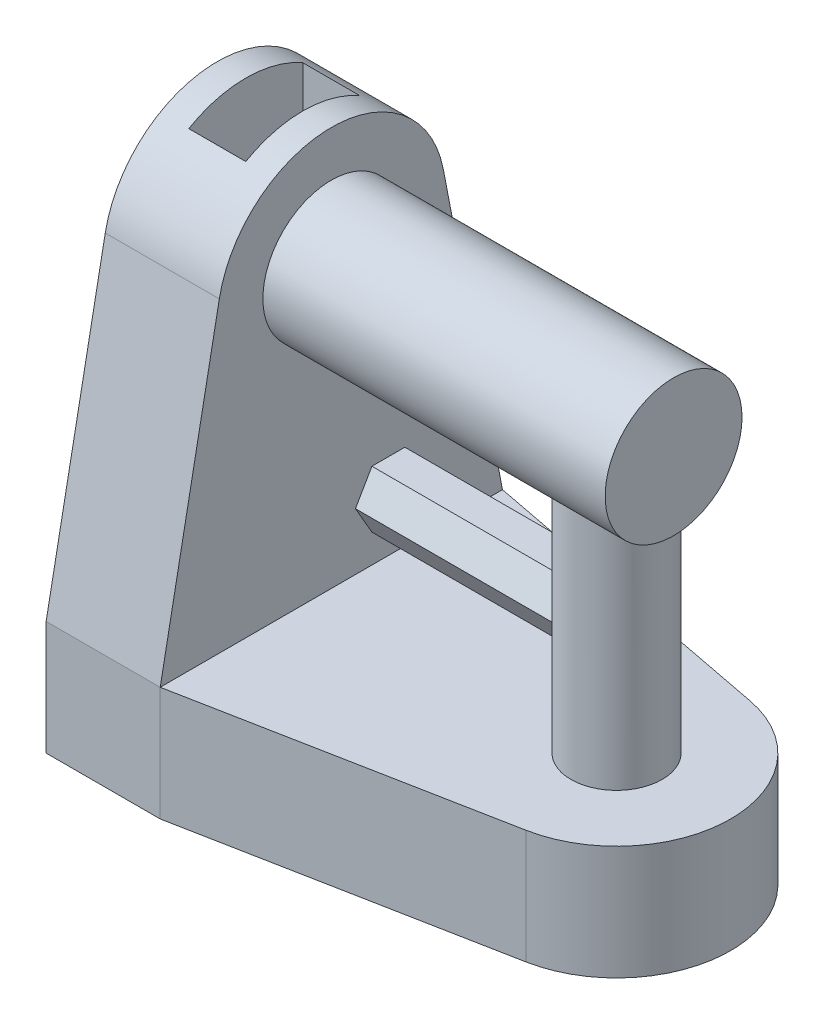
ISO-10303-21;
HEADER;
FILE_DESCRIPTION(('STEP AP214'),'2;1');
FILE_NAME('part.step','',(''),(''),'','','');
FILE_SCHEMA(('AUTOMOTIVE_DESIGN { 1 0 10303 214 1 1 1 1 }'));
ENDSEC;
DATA;
#1=APPLICATION_CONTEXT('core data for automotive mechanical design processes');
#2=APPLICATION_PROTOCOL_DEFINITION('international standard','automotive_design',2000,#1);
#3=PRODUCT_CONTEXT('',#1,'mechanical');
#4=PRODUCT('Part','Part','',(#3));
#5=PRODUCT_RELATED_PRODUCT_CATEGORY('part','',(#4));
#6=PRODUCT_DEFINITION_FORMATION('','',#4);
#7=PRODUCT_DEFINITION_CONTEXT('part definition',#1,'design');
#8=PRODUCT_DEFINITION('design','',#6,#7);
#9=PRODUCT_DEFINITION_SHAPE('','',#8);
#10=(LENGTH_UNIT() NAMED_UNIT(*) SI_UNIT(.MILLI.,.METRE.));
#11=(NAMED_UNIT(*) PLANE_ANGLE_UNIT() SI_UNIT($,.RADIAN.));
#12=(NAMED_UNIT(*) SI_UNIT($,.STERADIAN.) SOLID_ANGLE_UNIT());
#13=UNCERTAINTY_MEASURE_WITH_UNIT(LENGTH_MEASURE(1.E-05),#10,'distance_accuracy_value','');
#14=(GEOMETRIC_REPRESENTATION_CONTEXT(3) GLOBAL_UNCERTAINTY_ASSIGNED_CONTEXT((#13)) GLOBAL_UNIT_ASSIGNED_CONTEXT((#10,
#11,#12)) REPRESENTATION_CONTEXT('',''));
#15=CARTESIAN_POINT('',(0.,0.,0.));
#16=DIRECTION('',(0.,0.,1.));
#17=DIRECTION('',(1.,0.,0.));
#18=AXIS2_PLACEMENT_3D('',#15,#16,#17);
#19=CARTESIAN_POINT('',(5.,35.,0.));
#20=DIRECTION('',(1.,0.,0.));
#21=DIRECTION('',(0.,0.,-1.));
#22=AXIS2_PLACEMENT_3D('',#19,#20,#21);
#23=PLANE('',#22);
#24=DIRECTION('',(0.,0.,1.));
#25=VECTOR('',#24,1.);
#26=CARTESIAN_POINT('',(5.,10.,-15.));
#27=LINE('',#26,#25);
#28=CARTESIAN_POINT('',(5.,10.,-15.));
#29=VERTEX_POINT('',#28);
#30=CARTESIAN_POINT('',(5.,10.,15.));
#31=VERTEX_POINT('',#30);
#32=EDGE_CURVE('E251',#29,#31,#27,.T.);
#33=ORIENTED_EDGE('',*,*,#32,.F.);
#34=DIRECTION('',(0.,-0.981944937507597,-0.189166962504558));
#35=VECTOR('',#34,1.);
#36=CARTESIAN_POINT('',(5.,10.,-15.));
#37=LINE('',#36,#35);
#38=CARTESIAN_POINT('',(5.,36.8916696250456,-9.81944937507597));
#39=VERTEX_POINT('',#38);
#40=EDGE_CURVE('E261',#39,#29,#37,.T.);
#41=ORIENTED_EDGE('',*,*,#40,.F.);
#42=CARTESIAN_POINT('',(5.,35.,0.));
#43=DIRECTION('',(-1.,0.,0.));
#44=DIRECTION('',(0.,0.,-1.));
#45=AXIS2_PLACEMENT_3D('',#42,#43,#44);
#46=CIRCLE('',#45,10.);
#47=CARTESIAN_POINT('',(5.,36.8916696250456,9.81944937507597));
#48=VERTEX_POINT('',#47);
#49=EDGE_CURVE('E258',#48,#39,#46,.T.);
#50=ORIENTED_EDGE('',*,*,#49,.F.);
#51=DIRECTION('',(0.,0.981944937507597,-0.189166962504558));
#52=VECTOR('',#51,1.);
#53=CARTESIAN_POINT('',(5.,10.,15.));
#54=LINE('',#53,#52);
#55=EDGE_CURVE('E254',#31,#48,#54,.T.);
#56=ORIENTED_EDGE('',*,*,#55,.F.);
#57=EDGE_LOOP('',(#33,#41,#50,#56));
#58=FACE_BOUND('',#57,.T.);
#59=CARTESIAN_POINT('',(5.,35.,0.));
#60=DIRECTION('',(1.,0.,0.));
#61=DIRECTION('',(0.,0.,-1.));
#62=AXIS2_PLACEMENT_3D('',#59,#60,#61);
#63=CIRCLE('',#62,6.);
#64=CARTESIAN_POINT('',(5.,35.,-6.));
#65=VERTEX_POINT('',#64);
#66=EDGE_CURVE('E244',#65,#65,#63,.T.);
#67=ORIENTED_EDGE('',*,*,#66,.F.);
#68=EDGE_LOOP('',(#67));
#69=FACE_BOUND('',#68,.T.);
#70=ADVANCED_FACE('F33',(#58,#69),#23,.T.);
#71=CARTESIAN_POINT('',(30.,45.001,0.));
#72=DIRECTION('',(0.,-1.,0.));
#73=DIRECTION('',(0.,0.,-1.));
#74=AXIS2_PLACEMENT_3D('',#71,#72,#73);
#75=CYLINDRICAL_SURFACE('',#74,4.00000000000001);
#76=CARTESIAN_POINT('',(30.,30.5278640450004,-4.00000000000001));
#77=CARTESIAN_POINT('',(30.0976431042768,30.527863470965,-3.99999971701141));
#78=CARTESIAN_POINT('',(30.195294310192,30.5246517403185,-3.99641730612006));
#79=CARTESIAN_POINT('',(30.389671110508,30.5119680627168,-3.98216749684183));
#80=CARTESIAN_POINT('',(30.4863965548096,30.5024951174709,-3.97149896863995));
#81=CARTESIAN_POINT('',(30.6782023082901,30.4777326850487,-3.94327894993262));
#82=CARTESIAN_POINT('',(30.7732803736535,30.4624358307834,-3.92571874076453));
#83=CARTESIAN_POINT('',(30.9610171852617,30.4267031773503,-3.88403234303041));
#84=CARTESIAN_POINT('',(31.0536746671239,30.4062647494913,-3.85990279529086));
#85=CARTESIAN_POINT('',(31.3253430640324,30.3388831274365,-3.77874337281403));
#86=CARTESIAN_POINT('',(31.5001398237842,30.2855733248822,-3.7126228975306));
#87=CARTESIAN_POINT('',(31.8357672417761,30.1683135446415,-3.55867162885036));
#88=CARTESIAN_POINT('',(31.9965949902182,30.1043613581573,-3.47083632675902));
#89=CARTESIAN_POINT('',(32.3272770756849,29.9610824690513,-3.26005745637002));
#90=CARTESIAN_POINT('',(32.4946397531596,29.8809121193299,-3.13377721125875));
#91=CARTESIAN_POINT('',(32.8080299250533,29.7210926060203,-2.85635586366971));
#92=CARTESIAN_POINT('',(32.9540363860923,29.6414440290682,-2.70519055954671));
#93=CARTESIAN_POINT('',(33.1646650048039,29.5217559528442,-2.44937953697576));
#94=CARTESIAN_POINT('',(33.2374144461363,29.479327329696,-2.35243673498693));
#95=CARTESIAN_POINT('',(33.3743781204244,29.3979121788713,-2.15136155819083));
#96=CARTESIAN_POINT('',(33.4385959921753,29.3589241861311,-2.04723227746582));
#97=CARTESIAN_POINT('',(33.5577531929529,29.2855088130281,-1.83234219550542));
#98=CARTESIAN_POINT('',(33.6126977610832,29.2510788599137,-1.72158518694981));
#99=CARTESIAN_POINT('',(33.7125542263129,29.1878088804673,-1.49410810151116));
#100=CARTESIAN_POINT('',(33.7574682724242,29.158967656941,-1.37738930852113));
#101=CARTESIAN_POINT('',(33.8320471350762,29.1106984926508,-1.15232476869448));
#102=CARTESIAN_POINT('',(33.8628568113038,29.0905778506192,-1.04450655364945));
#103=CARTESIAN_POINT('',(33.9154435648975,29.0560700183122,-0.825799105876758));
#104=CARTESIAN_POINT('',(33.9372224112483,29.0416817051936,-0.714910479134198));
#105=CARTESIAN_POINT('',(33.9713394926245,29.0190824980026,-0.491177676230208));
#106=CARTESIAN_POINT('',(33.9836870066422,29.010865532399,-0.378335534131117));
#107=CARTESIAN_POINT('',(33.9987329630872,29.0008473266691,-0.151731846797384));
#108=CARTESIAN_POINT('',(34.0014327669545,28.9990451813132,-0.0379704335570359));
#109=CARTESIAN_POINT('',(33.9974640170715,29.001690307,0.17194106385991));
#110=CARTESIAN_POINT('',(33.9921608550798,29.0052267836771,0.26813220215228));
#111=CARTESIAN_POINT('',(33.9746673416514,29.0168622333477,0.459637324613926));
#112=CARTESIAN_POINT('',(33.9624749746702,29.0249625415595,0.554951043783097));
#113=CARTESIAN_POINT('',(33.9313723751175,29.0455435050924,0.743961586831337));
#114=CARTESIAN_POINT('',(33.9124644273917,29.0580226705751,0.837658949289283));
#115=CARTESIAN_POINT('',(33.8681791185832,29.0870874525479,1.02287485090367));
#116=CARTESIAN_POINT('',(33.8427992486999,29.1036746614238,1.11439253004272));
#117=CARTESIAN_POINT('',(33.7576294483595,29.1589481092498,1.38404430733352));
#118=CARTESIAN_POINT('',(33.6886486766977,29.2032550554807,1.55823034228987));
#119=CARTESIAN_POINT('',(33.528886265822,29.3035812959582,1.89244921235387));
#120=CARTESIAN_POINT('',(33.438100647106,29.3596027279201,2.05247945665022));
#121=CARTESIAN_POINT('',(33.2240481480507,29.4876348904946,2.37655495419077));
#122=CARTESIAN_POINT('',(33.0980806686548,29.5607793602742,2.53836442964145));
#123=CARTESIAN_POINT('',(32.8241869012186,29.7120004467449,2.83999471116366));
#124=CARTESIAN_POINT('',(32.6762267403406,29.790084562927,2.97978090076152));
#125=CARTESIAN_POINT('',(32.4272157467474,29.9122601545878,3.18157014723171));
#126=CARTESIAN_POINT('',(32.3327122786836,29.9567935448526,3.25150721692609));
#127=CARTESIAN_POINT('',(32.1373703349888,30.0441245689221,3.38312626486037));
#128=CARTESIAN_POINT('',(32.0365304414777,30.0869218106838,3.44480638573596));
#129=CARTESIAN_POINT('',(31.7251286099312,30.2104456187102,3.61662345708335));
#130=CARTESIAN_POINT('',(31.5051935364611,30.2865590366495,3.71393763368291));
#131=CARTESIAN_POINT('',(31.1105379100378,30.3947494083539,3.84666645765779));
#132=CARTESIAN_POINT('',(30.9408068425342,30.4331945331535,3.89181903898199));
#133=CARTESIAN_POINT('',(30.5939274265525,30.4918173826758,3.9595879131438));
#134=CARTESIAN_POINT('',(30.4167924976168,30.5120267753625,3.98224328128926));
#135=CARTESIAN_POINT('',(30.059112299703,30.5310493513616,4.00358886469356));
#136=CARTESIAN_POINT('',(29.8785555801528,30.5297694540124,4.00217482316116));
#137=CARTESIAN_POINT('',(29.520632795272,30.5058022611727,3.9752323660432));
#138=CARTESIAN_POINT('',(29.3432694350488,30.4830976129225,3.94968440341475));
#139=CARTESIAN_POINT('',(29.0052210476366,30.4214404824146,3.87799627166597));
#140=CARTESIAN_POINT('',(28.8441445434649,30.3833362662452,3.83292347110555));
#141=CARTESIAN_POINT('',(28.5317475654912,30.2954008260378,3.72446085129647));
#142=CARTESIAN_POINT('',(28.3804303890262,30.2455656646915,3.66106488053104));
#143=CARTESIAN_POINT('',(28.0595959503868,30.127770315384,3.50326678270747));
#144=CARTESIAN_POINT('',(27.8924862465556,30.0581783107192,3.40519994649144));
#145=CARTESIAN_POINT('',(27.575166525284,29.9147497645359,3.18705526067334));
#146=CARTESIAN_POINT('',(27.4249774468881,29.8409081311489,3.06695061214939));
#147=CARTESIAN_POINT('',(27.1120747197568,29.6784861532159,2.77753026108397));
#148=CARTESIAN_POINT('',(26.9537919003245,29.5902098033537,2.60319582989026));
#149=CARTESIAN_POINT('',(26.6683690351654,29.424489516018,2.22621086715598));
#150=CARTESIAN_POINT('',(26.5412014731386,29.3470360337008,2.02358560510326));
#151=CARTESIAN_POINT('',(26.3442092379586,29.2241800771393,1.63493887447291));
#152=CARTESIAN_POINT('',(26.2680622195085,29.1754789418587,1.45320204698569));
#153=CARTESIAN_POINT('',(26.1740745586927,29.1146664778858,1.17138183549999));
#154=CARTESIAN_POINT('',(26.1461149257805,29.0964337937293,1.07589158653011));
#155=CARTESIAN_POINT('',(26.0972694545791,29.0644325439445,0.882402094517285));
#156=CARTESIAN_POINT('',(26.0763807550408,29.0506621727404,0.784403883627614));
#157=CARTESIAN_POINT('',(26.0418835857237,29.0278548236481,0.586086273383305));
#158=CARTESIAN_POINT('',(26.028311496449,29.0188415038965,0.485757815796158));
#159=CARTESIAN_POINT('',(26.008814693063,29.0058773168529,0.284073777175728));
#160=CARTESIAN_POINT('',(26.0028868033578,29.0019243473683,0.182718640298796));
#161=CARTESIAN_POINT('',(25.9987634443807,28.9991757547367,-0.0202340535985191));
#162=CARTESIAN_POINT('',(26.0005691278935,29.0003809004706,-0.121831644503652));
#163=CARTESIAN_POINT('',(26.0118857118074,29.0079187327003,-0.324399587194821));
#164=CARTESIAN_POINT('',(26.0213962615432,29.0142511858412,-0.425369967315856));
#165=CARTESIAN_POINT('',(26.0470023275517,29.0312391873884,-0.618542762281547));
#166=CARTESIAN_POINT('',(26.0625661779277,29.0415452188539,-0.710846956330403));
#167=CARTESIAN_POINT('',(26.0999824795419,29.0662033732281,-0.893633165742335));
#168=CARTESIAN_POINT('',(26.1218370635487,29.0805568683283,-0.984114551962118));
#169=CARTESIAN_POINT('',(26.1964589718197,29.1292695863863,-1.25193819195834));
#170=CARTESIAN_POINT('',(26.2583061330578,29.1692957859349,-1.42581956476814));
#171=CARTESIAN_POINT('',(26.4078823792224,29.2641671012753,-1.77032329578653));
#172=CARTESIAN_POINT('',(26.4969019910084,29.3197356675528,-1.94017490918904));
#173=CARTESIAN_POINT('',(26.6962999124083,29.4404911884233,-2.26309758994045));
#174=CARTESIAN_POINT('',(26.8066910022958,29.505683892742,-2.41615853013136));
#175=CARTESIAN_POINT('',(27.0652584222062,29.6521415723269,-2.72659100620766));
#176=CARTESIAN_POINT('',(27.216646867733,29.7343217266756,-2.88085428517869));
#177=CARTESIAN_POINT('',(27.5422262620958,29.8989328427842,-3.16319975045766));
#178=CARTESIAN_POINT('',(27.7164341109153,29.9813639457616,-3.29126235074366));
#179=CARTESIAN_POINT('',(28.071737644694,30.1323155571641,-3.51026526963469));
#180=CARTESIAN_POINT('',(28.2512923961382,30.2014176035481,-3.60329311149619));
#181=CARTESIAN_POINT('',(28.6265601389144,30.3250506284993,-3.76231587359292));
#182=CARTESIAN_POINT('',(28.8222408392579,30.3796098424283,-3.82836331194185));
#183=CARTESIAN_POINT('',(29.1815682706406,30.4561770402045,-3.91872563367308));
#184=CARTESIAN_POINT('',(29.3427012714296,30.4827196587154,-3.9490458292026));
#185=CARTESIAN_POINT('',(29.5875599518574,30.5096244271931,-3.9795333908914));
#186=CARTESIAN_POINT('',(29.6697124198398,30.5164411842418,-3.98719713542874));
#187=CARTESIAN_POINT('',(29.8345747548414,30.5255606463525,-3.99742989402556));
#188=CARTESIAN_POINT('',(29.9172844704958,30.5278645312779,-4.0000002397256));
#189=CARTESIAN_POINT('',(30.,30.5278640450004,-4.00000000000001));
#190=B_SPLINE_CURVE_WITH_KNOTS('',3,(#76,#77,#78,#79,#80,#81,#82,#83,#84,#85,#86,#87,#88,#89,
#90,#91,#92,#93,#94,#95,#96,#97,#98,#99,#100,#101,#102,#103,#104,#105,#106,#107,#108,#109,#110,
#111,#112,#113,#114,#115,#116,#117,#118,#119,#120,#121,#122,#123,#124,#125,#126,#127,#128,#129,
#130,#131,#132,#133,#134,#135,#136,#137,#138,#139,#140,#141,#142,#143,#144,#145,#146,#147,#148,
#149,#150,#151,#152,#153,#154,#155,#156,#157,#158,#159,#160,#161,#162,#163,#164,#165,#166,#167,
#168,#169,#170,#171,#172,#173,#174,#175,#176,#177,#178,#179,#180,#181,#182,#183,#184,#185,#186,
#187,#188,#189),.UNSPECIFIED.,.T.,.F.,(4,2,2,2,2,2,2,2,2,2,2,2,2,2,2,2,2,2,2,2,2,2,2,2,2,2,2,2,
2,2,2,2,2,2,2,2,2,2,2,2,2,2,2,2,2,2,2,2,2,2,2,2,2,2,2,2,4),(0.,0.292826766938384,
0.585700233571986,0.878945414888604,1.17234082709947,1.75280804501344,2.33339588791187,
3.00435628395762,3.67597311129731,4.06076920977816,4.44540065855947,4.82981407081668,
5.21414504437428,5.55540517330863,5.89659842362192,6.2374555578977,6.57826459009639,
6.86712000583198,7.15605997452398,7.44490173103992,7.73385562594051,8.30887949972941,
8.88400839832559,9.53471337919829,10.1864311561984,10.5631761651892,10.9400057794147,
11.6916411041948,12.2289535173424,12.7653310340256,13.3040324620766,13.8431705807278,
14.3559607435296,14.8689232623495,15.4844163104974,16.1006628454805,16.8515253998696,
17.601721520902,18.2078433216843,18.5109911513255,18.814016165318,19.1185343346241,
19.4229259585792,19.7273629574471,20.0317861015004,20.3139756044281,20.5962608919215,
21.1603518047837,21.7570825066449,22.3541711655486,23.0451693726172,23.736682255299,
24.3754077628613,25.0128839799114,25.509057573012,25.7571821720891,26.0052418918174),.UNSPECIFIED.);
#191=CARTESIAN_POINT('',(30.,30.5278640450004,-4.00000000000001));
#192=VERTEX_POINT('',#191);
#193=EDGE_CURVE('E41',#192,#192,#190,.T.);
#194=ORIENTED_EDGE('',*,*,#193,.T.);
#195=EDGE_LOOP('',(#194));
#196=FACE_BOUND('',#195,.T.);
#197=CARTESIAN_POINT('',(30.,10.,0.));
#198=DIRECTION('',(0.,1.,0.));
#199=DIRECTION('',(0.,0.,1.));
#200=AXIS2_PLACEMENT_3D('',#197,#198,#199);
#201=CIRCLE('',#200,4.00000000000001);
#202=CARTESIAN_POINT('',(30.,10.,4.00000000000001));
#203=VERTEX_POINT('',#202);
#204=EDGE_CURVE('E231',#203,#203,#201,.T.);
#205=ORIENTED_EDGE('',*,*,#204,.T.);
#206=EDGE_LOOP('',(#205));
#207=FACE_BOUND('',#206,.T.);
#208=CARTESIAN_POINT('',(30.,25.,0.));
#209=DIRECTION('',(0.,-0.5,0.866025403784439));
#210=DIRECTION('',(0.,-0.866025403784439,-0.5));
#211=AXIS2_PLACEMENT_3D('',#208,#209,#210);
#212=ELLIPSE('',#211,8.00000000000001,4.00000000000001);
#213=CARTESIAN_POINT('',(27.2311253790678,20.0000000000673,-2.88675134598696));
#214=VERTEX_POINT('',#213);
#215=CARTESIAN_POINT('',(26.2694951190927,22.5,-1.44337567304101));
#216=VERTEX_POINT('',#215);
#217=EDGE_CURVE('E211',#214,#216,#212,.F.);
#218=ORIENTED_EDGE('',*,*,#217,.T.);
#219=CARTESIAN_POINT('',(30.,22.5,0.));
#220=DIRECTION('',(0.,-1.,0.));
#221=DIRECTION('',(0.,0.,-1.));
#222=AXIS2_PLACEMENT_3D('',#219,#220,#221);
#223=CIRCLE('',#222,4.00000000000001);
#224=CARTESIAN_POINT('',(26.2694951190383,22.5,1.44337567297407));
#225=VERTEX_POINT('',#224);
#226=EDGE_CURVE('E216',#216,#225,#223,.F.);
#227=ORIENTED_EDGE('',*,*,#226,.T.);
#228=CARTESIAN_POINT('',(30.,25.,0.));
#229=DIRECTION('',(0.,-0.5,-0.866025403784438));
#230=DIRECTION('',(0.,-0.866025403784439,0.5));
#231=AXIS2_PLACEMENT_3D('',#228,#229,#230);
#232=ELLIPSE('',#231,8.00000000000001,4.00000000000001);
#233=CARTESIAN_POINT('',(27.2311253790192,20.0000000000134,2.88675134594037));
#234=VERTEX_POINT('',#233);
#235=EDGE_CURVE('E233',#225,#234,#232,.F.);
#236=ORIENTED_EDGE('',*,*,#235,.T.);
#237=CARTESIAN_POINT('',(30.,15.,0.));
#238=DIRECTION('',(0.,0.5,-0.866025403784439));
#239=DIRECTION('',(0.,-0.866025403784439,-0.5));
#240=AXIS2_PLACEMENT_3D('',#237,#238,#239);
#241=ELLIPSE('',#240,8.00000000000001,4.00000000000001);
#242=CARTESIAN_POINT('',(26.2694951190668,17.5,1.44337567297407));
#243=VERTEX_POINT('',#242);
#244=EDGE_CURVE('E235',#234,#243,#241,.F.);
#245=ORIENTED_EDGE('',*,*,#244,.T.);
#246=CARTESIAN_POINT('',(30.,17.5,0.));
#247=DIRECTION('',(0.,1.,0.));
#248=DIRECTION('',(0.,0.,1.));
#249=AXIS2_PLACEMENT_3D('',#246,#247,#248);
#250=CIRCLE('',#249,4.00000000000001);
#251=CARTESIAN_POINT('',(26.2694951190631,17.5,-1.44337567296449));
#252=VERTEX_POINT('',#251);
#253=EDGE_CURVE('E237',#243,#252,#250,.F.);
#254=ORIENTED_EDGE('',*,*,#253,.T.);
#255=CARTESIAN_POINT('',(30.,15.,0.));
#256=DIRECTION('',(0.,0.5,0.866025403784439));
#257=DIRECTION('',(0.,-0.866025403784439,0.5));
#258=AXIS2_PLACEMENT_3D('',#255,#256,#257);
#259=ELLIPSE('',#258,8.00000000000002,4.00000000000001);
#260=EDGE_CURVE('E239',#252,#214,#259,.F.);
#261=ORIENTED_EDGE('',*,*,#260,.T.);
#262=EDGE_LOOP('',(#218,#227,#236,#245,#254,#261));
#263=FACE_BOUND('',#262,.T.);
#264=ADVANCED_FACE('F326',(#196,#207,#263),#75,.T.);
#265=CARTESIAN_POINT('',(0.,10.,0.));
#266=DIRECTION('',(0.,1.,0.));
#267=DIRECTION('',(0.,0.,1.));
#268=AXIS2_PLACEMENT_3D('',#265,#266,#267);
#269=PLANE('',#268);
#270=DIRECTION('',(0.981944937507597,0.,0.189166962504558));
#271=VECTOR('',#270,1.);
#272=CARTESIAN_POINT('',(2.96519381614161,10.,-15.3919956103272));
#273=LINE('',#272,#271);
#274=CARTESIAN_POINT('',(31.8916696250456,10.,-9.81944937507597));
#275=VERTEX_POINT('',#274);
#276=EDGE_CURVE('E285',#29,#275,#273,.T.);
#277=ORIENTED_EDGE('',*,*,#276,.F.);
#278=ORIENTED_EDGE('',*,*,#32,.T.);
#279=DIRECTION('',(0.981944937507597,0.,-0.189166962504558));
#280=VECTOR('',#279,1.);
#281=CARTESIAN_POINT('',(2.96519381614161,10.,15.3919956103272));
#282=LINE('',#281,#280);
#283=CARTESIAN_POINT('',(31.8916696250456,10.,9.81944937507597));
#284=VERTEX_POINT('',#283);
#285=EDGE_CURVE('E279',#31,#284,#282,.T.);
#286=ORIENTED_EDGE('',*,*,#285,.T.);
#287=CARTESIAN_POINT('',(30.,10.,0.));
#288=DIRECTION('',(0.,1.,0.));
#289=DIRECTION('',(0.,0.,1.));
#290=AXIS2_PLACEMENT_3D('',#287,#288,#289);
#291=CIRCLE('',#290,10.);
#292=EDGE_CURVE('E282',#275,#284,#291,.F.);
#293=ORIENTED_EDGE('',*,*,#292,.F.);
#294=EDGE_LOOP('',(#277,#278,#286,#293));
#295=FACE_BOUND('',#294,.T.);
#296=ORIENTED_EDGE('',*,*,#204,.F.);
#297=EDGE_LOOP('',(#296));
#298=FACE_BOUND('',#297,.T.);
#299=ADVANCED_FACE('F330',(#295,#298),#269,.T.);
#300=CARTESIAN_POINT('',(35.,35.,0.));
#301=DIRECTION('',(-1.,0.,0.));
#302=DIRECTION('',(0.,0.,1.));
#303=AXIS2_PLACEMENT_3D('',#300,#301,#302);
#304=CYLINDRICAL_SURFACE('',#303,6.);
#305=ORIENTED_EDGE('',*,*,#66,.T.);
#306=EDGE_LOOP('',(#305));
#307=FACE_BOUND('',#306,.T.);
#308=CARTESIAN_POINT('',(35.,35.,0.));
#309=DIRECTION('',(1.,0.,0.));
#310=DIRECTION('',(0.,0.,-1.));
#311=AXIS2_PLACEMENT_3D('',#308,#309,#310);
#312=CIRCLE('',#311,6.);
#313=CARTESIAN_POINT('',(35.,35.,-6.));
#314=VERTEX_POINT('',#313);
#315=EDGE_CURVE('E245',#314,#314,#312,.T.);
#316=ORIENTED_EDGE('',*,*,#315,.F.);
#317=EDGE_LOOP('',(#316));
#318=FACE_BOUND('',#317,.T.);
#319=ORIENTED_EDGE('',*,*,#193,.F.);
#320=EDGE_LOOP('',(#319));
#321=FACE_BOUND('',#320,.T.);
#322=ADVANCED_FACE('F322',(#307,#318,#321),#304,.T.);
#323=CARTESIAN_POINT('',(-5.,10.,0.));
#324=DIRECTION('',(-1.,0.,0.));
#325=DIRECTION('',(0.,0.,1.));
#326=AXIS2_PLACEMENT_3D('',#323,#324,#325);
#327=PLANE('',#326);
#328=DIRECTION('',(0.,0.,-1.));
#329=VECTOR('',#328,1.);
#330=CARTESIAN_POINT('',(-5.,0.,0.));
#331=LINE('',#330,#329);
#332=CARTESIAN_POINT('',(-5.,0.,15.));
#333=VERTEX_POINT('',#332);
#334=CARTESIAN_POINT('',(-5.,0.,-15.));
#335=VERTEX_POINT('',#334);
#336=EDGE_CURVE('E274',#333,#335,#331,.T.);
#337=ORIENTED_EDGE('',*,*,#336,.F.);
#338=DIRECTION('',(0.,-1.,0.));
#339=VECTOR('',#338,1.);
#340=CARTESIAN_POINT('',(-5.,10.,15.));
#341=LINE('',#340,#339);
#342=CARTESIAN_POINT('',(-5.,10.,15.));
#343=VERTEX_POINT('',#342);
#344=EDGE_CURVE('E316',#343,#333,#341,.T.);
#345=ORIENTED_EDGE('',*,*,#344,.F.);
#346=DIRECTION('',(0.,0.981944937507597,-0.189166962504558));
#347=VECTOR('',#346,1.);
#348=CARTESIAN_POINT('',(-5.,10.,15.));
#349=LINE('',#348,#347);
#350=CARTESIAN_POINT('',(-5.,36.8916696250456,9.81944937507597));
#351=VERTEX_POINT('',#350);
#352=EDGE_CURVE('E248',#343,#351,#349,.T.);
#353=ORIENTED_EDGE('',*,*,#352,.T.);
#354=CARTESIAN_POINT('',(-5.,35.,0.));
#355=DIRECTION('',(-1.,0.,0.));
#356=DIRECTION('',(0.,0.,-1.));
#357=AXIS2_PLACEMENT_3D('',#354,#355,#356);
#358=CIRCLE('',#357,10.);
#359=CARTESIAN_POINT('',(-5.,36.8916696250456,-9.81944937507597));
#360=VERTEX_POINT('',#359);
#361=EDGE_CURVE('E267',#351,#360,#358,.T.);
#362=ORIENTED_EDGE('',*,*,#361,.T.);
#363=DIRECTION('',(0.,-0.981944937507597,-0.189166962504558));
#364=VECTOR('',#363,1.);
#365=CARTESIAN_POINT('',(-5.,10.,-15.));
#366=LINE('',#365,#364);
#367=CARTESIAN_POINT('',(-5.,10.,-15.));
#368=VERTEX_POINT('',#367);
#369=EDGE_CURVE('E255',#360,#368,#366,.T.);
#370=ORIENTED_EDGE('',*,*,#369,.T.);
#371=DIRECTION('',(0.,-1.,0.));
#372=VECTOR('',#371,1.);
#373=CARTESIAN_POINT('',(-5.,10.,-15.));
#374=LINE('',#373,#372);
#375=EDGE_CURVE('E290',#368,#335,#374,.T.);
#376=ORIENTED_EDGE('',*,*,#375,.T.);
#377=EDGE_LOOP('',(#337,#345,#353,#362,#370,#376));
#378=FACE_BOUND('',#377,.T.);
#379=ADVANCED_FACE('F35',(#378),#327,.T.);
#380=CARTESIAN_POINT('',(0.,10.,15.));
#381=DIRECTION('',(0.,0.,1.));
#382=DIRECTION('',(1.,0.,0.));
#383=AXIS2_PLACEMENT_3D('',#380,#381,#382);
#384=PLANE('',#383);
#385=DIRECTION('',(-1.,0.,0.));
#386=VECTOR('',#385,1.);
#387=CARTESIAN_POINT('',(0.,0.,15.));
#388=LINE('',#387,#386);
#389=CARTESIAN_POINT('',(5.,0.,15.));
#390=VERTEX_POINT('',#389);
#391=EDGE_CURVE('E293',#390,#333,#388,.T.);
#392=ORIENTED_EDGE('',*,*,#391,.F.);
#393=DIRECTION('',(0.,-1.,0.));
#394=VECTOR('',#393,1.);
#395=CARTESIAN_POINT('',(5.,10.,15.));
#396=LINE('',#395,#394);
#397=EDGE_CURVE('E314',#31,#390,#396,.T.);
#398=ORIENTED_EDGE('',*,*,#397,.F.);
#399=DIRECTION('',(-1.,0.,0.));
#400=VECTOR('',#399,1.);
#401=CARTESIAN_POINT('',(0.,10.,15.));
#402=LINE('',#401,#400);
#403=EDGE_CURVE('E276',#31,#343,#402,.T.);
#404=ORIENTED_EDGE('',*,*,#403,.T.);
#405=ORIENTED_EDGE('',*,*,#344,.T.);
#406=EDGE_LOOP('',(#392,#398,#404,#405));
#407=FACE_BOUND('',#406,.T.);
#408=ADVANCED_FACE('F388',(#407),#384,.T.);
#409=CARTESIAN_POINT('',(2.96519381614161,10.,15.3919956103272));
#410=DIRECTION('',(-0.189166962504558,0.,-0.981944937507597));
#411=DIRECTION('',(-0.981944937507597,0.,0.189166962504558));
#412=AXIS2_PLACEMENT_3D('',#409,#410,#411);
#413=PLANE('',#412);
#414=DIRECTION('',(0.981944937507597,0.,-0.189166962504558));
#415=VECTOR('',#414,1.);
#416=CARTESIAN_POINT('',(2.96519381614161,0.,15.3919956103272));
#417=LINE('',#416,#415);
#418=CARTESIAN_POINT('',(31.8916696250456,0.,9.81944937507597));
#419=VERTEX_POINT('',#418);
#420=EDGE_CURVE('E296',#390,#419,#417,.T.);
#421=ORIENTED_EDGE('',*,*,#420,.T.);
#422=DIRECTION('',(0.,-1.,0.));
#423=VECTOR('',#422,1.);
#424=CARTESIAN_POINT('',(31.8916696250456,10.,9.81944937507597));
#425=LINE('',#424,#423);
#426=EDGE_CURVE('E312',#284,#419,#425,.T.);
#427=ORIENTED_EDGE('',*,*,#426,.F.);
#428=ORIENTED_EDGE('',*,*,#285,.F.);
#429=ORIENTED_EDGE('',*,*,#397,.T.);
#430=EDGE_LOOP('',(#421,#427,#428,#429));
#431=FACE_BOUND('',#430,.T.);
#432=ADVANCED_FACE('F385',(#431),#413,.F.);
#433=CARTESIAN_POINT('',(30.,10.,0.));
#434=DIRECTION('',(0.,-1.,0.));
#435=DIRECTION('',(0.,0.,-1.));
#436=AXIS2_PLACEMENT_3D('',#433,#434,#435);
#437=CYLINDRICAL_SURFACE('',#436,10.);
#438=CARTESIAN_POINT('',(30.,0.,0.));
#439=DIRECTION('',(0.,1.,0.));
#440=DIRECTION('',(0.,0.,1.));
#441=AXIS2_PLACEMENT_3D('',#438,#439,#440);
#442=CIRCLE('',#441,10.);
#443=CARTESIAN_POINT('',(31.8916696250456,0.,-9.81944937507597));
#444=VERTEX_POINT('',#443);
#445=EDGE_CURVE('E299',#444,#419,#442,.F.);
#446=ORIENTED_EDGE('',*,*,#445,.F.);
#447=DIRECTION('',(0.,-1.,0.));
#448=VECTOR('',#447,1.);
#449=CARTESIAN_POINT('',(31.8916696250456,10.,-9.81944937507597));
#450=LINE('',#449,#448);
#451=EDGE_CURVE('E310',#275,#444,#450,.T.);
#452=ORIENTED_EDGE('',*,*,#451,.F.);
#453=ORIENTED_EDGE('',*,*,#292,.T.);
#454=ORIENTED_EDGE('',*,*,#426,.T.);
#455=EDGE_LOOP('',(#446,#452,#453,#454));
#456=FACE_BOUND('',#455,.T.);
#457=ADVANCED_FACE('F381',(#456),#437,.T.);
#458=CARTESIAN_POINT('',(2.96519381614161,10.,-15.3919956103272));
#459=DIRECTION('',(0.189166962504558,0.,-0.981944937507597));
#460=DIRECTION('',(-0.981944937507597,0.,-0.189166962504558));
#461=AXIS2_PLACEMENT_3D('',#458,#459,#460);
#462=PLANE('',#461);
#463=DIRECTION('',(0.981944937507597,0.,0.189166962504558));
#464=VECTOR('',#463,1.);
#465=CARTESIAN_POINT('',(2.96519381614161,0.,-15.3919956103272));
#466=LINE('',#465,#464);
#467=CARTESIAN_POINT('',(5.,0.,-15.));
#468=VERTEX_POINT('',#467);
#469=EDGE_CURVE('E302',#468,#444,#466,.T.);
#470=ORIENTED_EDGE('',*,*,#469,.F.);
#471=DIRECTION('',(0.,-1.,0.));
#472=VECTOR('',#471,1.);
#473=CARTESIAN_POINT('',(5.,10.,-15.));
#474=LINE('',#473,#472);
#475=EDGE_CURVE('E308',#29,#468,#474,.T.);
#476=ORIENTED_EDGE('',*,*,#475,.F.);
#477=ORIENTED_EDGE('',*,*,#276,.T.);
#478=ORIENTED_EDGE('',*,*,#451,.T.);
#479=EDGE_LOOP('',(#470,#476,#477,#478));
#480=FACE_BOUND('',#479,.T.);
#481=ADVANCED_FACE('F377',(#480),#462,.T.);
#482=CARTESIAN_POINT('',(0.,10.,-15.));
#483=DIRECTION('',(0.,0.,1.));
#484=DIRECTION('',(1.,0.,0.));
#485=AXIS2_PLACEMENT_3D('',#482,#483,#484);
#486=PLANE('',#485);
#487=DIRECTION('',(-1.,0.,0.));
#488=VECTOR('',#487,1.);
#489=CARTESIAN_POINT('',(0.,0.,-15.));
#490=LINE('',#489,#488);
#491=EDGE_CURVE('E280',#468,#335,#490,.T.);
#492=ORIENTED_EDGE('',*,*,#491,.T.);
#493=ORIENTED_EDGE('',*,*,#375,.F.);
#494=DIRECTION('',(-1.,0.,0.));
#495=VECTOR('',#494,1.);
#496=CARTESIAN_POINT('',(0.,10.,-15.));
#497=LINE('',#496,#495);
#498=EDGE_CURVE('E288',#29,#368,#497,.T.);
#499=ORIENTED_EDGE('',*,*,#498,.F.);
#500=ORIENTED_EDGE('',*,*,#475,.T.);
#501=EDGE_LOOP('',(#492,#493,#499,#500));
#502=FACE_BOUND('',#501,.T.);
#503=ADVANCED_FACE('F373',(#502),#486,.F.);
#504=CARTESIAN_POINT('',(0.,0.,0.));
#505=DIRECTION('',(0.,1.,0.));
#506=DIRECTION('',(0.,0.,1.));
#507=AXIS2_PLACEMENT_3D('',#504,#505,#506);
#508=PLANE('',#507);
#509=ORIENTED_EDGE('',*,*,#336,.T.);
#510=ORIENTED_EDGE('',*,*,#491,.F.);
#511=ORIENTED_EDGE('',*,*,#469,.T.);
#512=ORIENTED_EDGE('',*,*,#445,.T.);
#513=ORIENTED_EDGE('',*,*,#420,.F.);
#514=ORIENTED_EDGE('',*,*,#391,.T.);
#515=EDGE_LOOP('',(#509,#510,#511,#512,#513,#514));
#516=FACE_BOUND('',#515,.T.);
#517=ADVANCED_FACE('F364',(#516),#508,.F.);
#518=CARTESIAN_POINT('',(5.,10.,-15.));
#519=DIRECTION('',(0.,0.189166962504558,-0.981944937507597));
#520=DIRECTION('',(0.,0.981944937507597,0.189166962504558));
#521=AXIS2_PLACEMENT_3D('',#518,#519,#520);
#522=PLANE('',#521);
#523=ORIENTED_EDGE('',*,*,#369,.F.);
#524=DIRECTION('',(-1.,0.,0.));
#525=VECTOR('',#524,1.);
#526=CARTESIAN_POINT('',(5.,36.8916696250456,-9.81944937507597));
#527=LINE('',#526,#525);
#528=EDGE_CURVE('E272',#39,#360,#527,.T.);
#529=ORIENTED_EDGE('',*,*,#528,.F.);
#530=ORIENTED_EDGE('',*,*,#40,.T.);
#531=ORIENTED_EDGE('',*,*,#498,.T.);
#532=EDGE_LOOP('',(#523,#529,#530,#531));
#533=FACE_BOUND('',#532,.T.);
#534=ADVANCED_FACE('F361',(#533),#522,.T.);
#535=CARTESIAN_POINT('',(5.,35.,0.));
#536=DIRECTION('',(-1.,0.,0.));
#537=DIRECTION('',(0.,0.,1.));
#538=AXIS2_PLACEMENT_3D('',#535,#536,#537);
#539=CYLINDRICAL_SURFACE('',#538,10.);
#540=DIRECTION('',(-1.,0.,0.));
#541=VECTOR('',#540,1.);
#542=CARTESIAN_POINT('',(5.,43.6602540378444,5.));
#543=LINE('',#542,#541);
#544=CARTESIAN_POINT('',(2.5,43.6602540378444,5.));
#545=VERTEX_POINT('',#544);
#546=CARTESIAN_POINT('',(-2.5,43.6602540378444,5.));
#547=VERTEX_POINT('',#546);
#548=EDGE_CURVE('E174',#545,#547,#543,.T.);
#549=ORIENTED_EDGE('',*,*,#548,.T.);
#550=CARTESIAN_POINT('',(-2.5,35.,0.));
#551=DIRECTION('',(-1.,0.,0.));
#552=DIRECTION('',(0.,0.,1.));
#553=AXIS2_PLACEMENT_3D('',#550,#551,#552);
#554=CIRCLE('',#553,10.);
#555=CARTESIAN_POINT('',(-2.5,43.6602540378444,-5.));
#556=VERTEX_POINT('',#555);
#557=EDGE_CURVE('E158',#547,#556,#554,.T.);
#558=ORIENTED_EDGE('',*,*,#557,.T.);
#559=DIRECTION('',(-1.,0.,0.));
#560=VECTOR('',#559,1.);
#561=CARTESIAN_POINT('',(5.,43.6602540378444,-5.));
#562=LINE('',#561,#560);
#563=CARTESIAN_POINT('',(2.5,43.6602540378444,-5.));
#564=VERTEX_POINT('',#563);
#565=EDGE_CURVE('E194',#564,#556,#562,.T.);
#566=ORIENTED_EDGE('',*,*,#565,.F.);
#567=CARTESIAN_POINT('',(2.5,35.,0.));
#568=DIRECTION('',(1.,0.,0.));
#569=DIRECTION('',(0.,0.,-1.));
#570=AXIS2_PLACEMENT_3D('',#567,#568,#569);
#571=CIRCLE('',#570,10.);
#572=EDGE_CURVE('E183',#564,#545,#571,.T.);
#573=ORIENTED_EDGE('',*,*,#572,.T.);
#574=EDGE_LOOP('',(#549,#558,#566,#573));
#575=FACE_BOUND('',#574,.T.);
#576=ORIENTED_EDGE('',*,*,#361,.F.);
#577=DIRECTION('',(-1.,0.,0.));
#578=VECTOR('',#577,1.);
#579=CARTESIAN_POINT('',(5.,36.8916696250456,9.81944937507597));
#580=LINE('',#579,#578);
#581=EDGE_CURVE('E264',#48,#351,#580,.T.);
#582=ORIENTED_EDGE('',*,*,#581,.F.);
#583=ORIENTED_EDGE('',*,*,#49,.T.);
#584=ORIENTED_EDGE('',*,*,#528,.T.);
#585=EDGE_LOOP('',(#576,#582,#583,#584));
#586=FACE_BOUND('',#585,.T.);
#587=ADVANCED_FACE('F181',(#575,#586),#539,.T.);
#588=CARTESIAN_POINT('',(5.,10.,15.));
#589=DIRECTION('',(0.,0.189166962504558,0.981944937507597));
#590=DIRECTION('',(0.,-0.981944937507597,0.189166962504558));
#591=AXIS2_PLACEMENT_3D('',#588,#589,#590);
#592=PLANE('',#591);
#593=ORIENTED_EDGE('',*,*,#352,.F.);
#594=ORIENTED_EDGE('',*,*,#403,.F.);
#595=ORIENTED_EDGE('',*,*,#55,.T.);
#596=ORIENTED_EDGE('',*,*,#581,.T.);
#597=EDGE_LOOP('',(#593,#594,#595,#596));
#598=FACE_BOUND('',#597,.T.);
#599=ADVANCED_FACE('F337',(#598),#592,.T.);
#600=CARTESIAN_POINT('',(35.,35.,0.));
#601=DIRECTION('',(1.,0.,0.));
#602=DIRECTION('',(0.,0.,-1.));
#603=AXIS2_PLACEMENT_3D('',#600,#601,#602);
#604=PLANE('',#603);
#605=ORIENTED_EDGE('',*,*,#315,.T.);
#606=EDGE_LOOP('',(#605));
#607=FACE_BOUND('',#606,.T.);
#608=ADVANCED_FACE('F334',(#607),#604,.T.);
#609=CARTESIAN_POINT('',(500000.,20.,-2.88675134594813));
#610=DIRECTION('',(0.,-0.5,0.866025403784439));
#611=DIRECTION('',(0.,-0.866025403784439,-0.5));
#612=AXIS2_PLACEMENT_3D('',#609,#610,#611);
#613=PLANE('',#612);
#614=DIRECTION('',(-1.,0.,0.));
#615=VECTOR('',#614,1.);
#616=CARTESIAN_POINT('',(500000.,20.,-2.88675134594813));
#617=LINE('',#616,#615);
#618=CARTESIAN_POINT('',(9.99999999999091,20.0000000000673,-2.88675134598696));
#619=VERTEX_POINT('',#618);
#620=EDGE_CURVE('E225',#214,#619,#617,.T.);
#621=ORIENTED_EDGE('',*,*,#620,.T.);
#622=DIRECTION('',(0.,0.866025403784439,0.5));
#623=VECTOR('',#622,1.);
#624=CARTESIAN_POINT('',(9.99999999999091,20.,-2.88675134594813));
#625=LINE('',#624,#623);
#626=CARTESIAN_POINT('',(9.99999999999091,22.5,-1.44337567304101));
#627=VERTEX_POINT('',#626);
#628=EDGE_CURVE('E208',#619,#627,#625,.T.);
#629=ORIENTED_EDGE('',*,*,#628,.T.);
#630=DIRECTION('',(-1.,0.,0.));
#631=VECTOR('',#630,1.);
#632=CARTESIAN_POINT('',(500000.,22.5,-1.44337567297406));
#633=LINE('',#632,#631);
#634=EDGE_CURVE('E228',#216,#627,#633,.T.);
#635=ORIENTED_EDGE('',*,*,#634,.F.);
#636=ORIENTED_EDGE('',*,*,#217,.F.);
#637=EDGE_LOOP('',(#621,#629,#635,#636));
#638=FACE_BOUND('',#637,.T.);
#639=ADVANCED_FACE('F336',(#638),#613,.F.);
#640=CARTESIAN_POINT('',(500000.,17.5,-1.44337567297406));
#641=DIRECTION('',(0.,0.5,0.866025403784439));
#642=DIRECTION('',(0.,-0.866025403784439,0.5));
#643=AXIS2_PLACEMENT_3D('',#640,#641,#642);
#644=PLANE('',#643);
#645=DIRECTION('',(-1.,0.,0.));
#646=VECTOR('',#645,1.);
#647=CARTESIAN_POINT('',(500000.,17.5,-1.44337567297406));
#648=LINE('',#647,#646);
#649=CARTESIAN_POINT('',(9.99999999999091,17.5,-1.44337567297406));
#650=VERTEX_POINT('',#649);
#651=EDGE_CURVE('E222',#252,#650,#648,.T.);
#652=ORIENTED_EDGE('',*,*,#651,.T.);
#653=DIRECTION('',(0.,0.866025403784439,-0.5));
#654=VECTOR('',#653,1.);
#655=CARTESIAN_POINT('',(9.99999999999091,17.5,-1.44337567297406));
#656=LINE('',#655,#654);
#657=EDGE_CURVE('E205',#650,#619,#656,.T.);
#658=ORIENTED_EDGE('',*,*,#657,.T.);
#659=ORIENTED_EDGE('',*,*,#620,.F.);
#660=ORIENTED_EDGE('',*,*,#260,.F.);
#661=EDGE_LOOP('',(#652,#658,#659,#660));
#662=FACE_BOUND('',#661,.T.);
#663=ADVANCED_FACE('F344',(#662),#644,.F.);
#664=CARTESIAN_POINT('',(500000.,17.5,1.44337567297407));
#665=DIRECTION('',(0.,1.,0.));
#666=DIRECTION('',(0.,0.,1.));
#667=AXIS2_PLACEMENT_3D('',#664,#665,#666);
#668=PLANE('',#667);
#669=DIRECTION('',(-1.,0.,0.));
#670=VECTOR('',#669,1.);
#671=CARTESIAN_POINT('',(500000.,17.5,1.44337567297407));
#672=LINE('',#671,#670);
#673=CARTESIAN_POINT('',(9.99999999999091,17.5,1.44337567297406));
#674=VERTEX_POINT('',#673);
#675=EDGE_CURVE('E219',#243,#674,#672,.T.);
#676=ORIENTED_EDGE('',*,*,#675,.T.);
#677=DIRECTION('',(0.,0.,-1.));
#678=VECTOR('',#677,1.);
#679=CARTESIAN_POINT('',(9.99999999999091,17.5,1.44337567297407));
#680=LINE('',#679,#678);
#681=EDGE_CURVE('E202',#674,#650,#680,.T.);
#682=ORIENTED_EDGE('',*,*,#681,.T.);
#683=ORIENTED_EDGE('',*,*,#651,.F.);
#684=ORIENTED_EDGE('',*,*,#253,.F.);
#685=EDGE_LOOP('',(#676,#682,#683,#684));
#686=FACE_BOUND('',#685,.T.);
#687=ADVANCED_FACE('F432',(#686),#668,.F.);
#688=CARTESIAN_POINT('',(500000.,20.,2.88675134594813));
#689=DIRECTION('',(0.,0.5,-0.866025403784439));
#690=DIRECTION('',(0.,0.866025403784439,0.5));
#691=AXIS2_PLACEMENT_3D('',#688,#689,#690);
#692=PLANE('',#691);
#693=DIRECTION('',(-1.,0.,0.));
#694=VECTOR('',#693,1.);
#695=CARTESIAN_POINT('',(500000.,20.,2.88675134594813));
#696=LINE('',#695,#694);
#697=CARTESIAN_POINT('',(9.99999999999091,20.,2.88675134594813));
#698=VERTEX_POINT('',#697);
#699=EDGE_CURVE('E215',#234,#698,#696,.T.);
#700=ORIENTED_EDGE('',*,*,#699,.T.);
#701=DIRECTION('',(0.,-0.866025403784439,-0.5));
#702=VECTOR('',#701,1.);
#703=CARTESIAN_POINT('',(9.99999999999091,20.,2.88675134594813));
#704=LINE('',#703,#702);
#705=EDGE_CURVE('E56',#698,#674,#704,.T.);
#706=ORIENTED_EDGE('',*,*,#705,.T.);
#707=ORIENTED_EDGE('',*,*,#675,.F.);
#708=ORIENTED_EDGE('',*,*,#244,.F.);
#709=EDGE_LOOP('',(#700,#706,#707,#708));
#710=FACE_BOUND('',#709,.T.);
#711=ADVANCED_FACE('F435',(#710),#692,.F.);
#712=CARTESIAN_POINT('',(500000.,22.5,-1.44337567297406));
#713=DIRECTION('',(0.,-1.,0.));
#714=DIRECTION('',(0.,0.,-1.));
#715=AXIS2_PLACEMENT_3D('',#712,#713,#714);
#716=PLANE('',#715);
#717=ORIENTED_EDGE('',*,*,#634,.T.);
#718=DIRECTION('',(0.,0.,1.));
#719=VECTOR('',#718,1.);
#720=CARTESIAN_POINT('',(9.99999999999091,22.5,-1.44337567297406));
#721=LINE('',#720,#719);
#722=CARTESIAN_POINT('',(9.99999999999091,22.5,1.44337567297407));
#723=VERTEX_POINT('',#722);
#724=EDGE_CURVE('E168',#627,#723,#721,.T.);
#725=ORIENTED_EDGE('',*,*,#724,.T.);
#726=DIRECTION('',(-1.,0.,0.));
#727=VECTOR('',#726,1.);
#728=CARTESIAN_POINT('',(500000.,22.5,1.44337567297407));
#729=LINE('',#728,#727);
#730=EDGE_CURVE('E212',#225,#723,#729,.T.);
#731=ORIENTED_EDGE('',*,*,#730,.F.);
#732=ORIENTED_EDGE('',*,*,#226,.F.);
#733=EDGE_LOOP('',(#717,#725,#731,#732));
#734=FACE_BOUND('',#733,.T.);
#735=ADVANCED_FACE('F351',(#734),#716,.F.);
#736=CARTESIAN_POINT('',(500000.,22.5,1.44337567297407));
#737=DIRECTION('',(0.,-0.5,-0.866025403784438));
#738=DIRECTION('',(0.,0.866025403784439,-0.5));
#739=AXIS2_PLACEMENT_3D('',#736,#737,#738);
#740=PLANE('',#739);
#741=ORIENTED_EDGE('',*,*,#730,.T.);
#742=DIRECTION('',(0.,-0.866025403784439,0.5));
#743=VECTOR('',#742,1.);
#744=CARTESIAN_POINT('',(9.99999999999091,22.5,1.44337567297407));
#745=LINE('',#744,#743);
#746=EDGE_CURVE('E11',#723,#698,#745,.T.);
#747=ORIENTED_EDGE('',*,*,#746,.T.);
#748=ORIENTED_EDGE('',*,*,#699,.F.);
#749=ORIENTED_EDGE('',*,*,#235,.F.);
#750=EDGE_LOOP('',(#741,#747,#748,#749));
#751=FACE_BOUND('',#750,.T.);
#752=ADVANCED_FACE('F332',(#751),#740,.F.);
#753=CARTESIAN_POINT('',(10.,0.,0.));
#754=DIRECTION('',(1.,0.,0.));
#755=DIRECTION('',(0.,0.,-1.));
#756=AXIS2_PLACEMENT_3D('',#753,#754,#755);
#757=PLANE('',#756);
#758=ORIENTED_EDGE('',*,*,#657,.F.);
#759=ORIENTED_EDGE('',*,*,#681,.F.);
#760=ORIENTED_EDGE('',*,*,#705,.F.);
#761=ORIENTED_EDGE('',*,*,#746,.F.);
#762=ORIENTED_EDGE('',*,*,#724,.F.);
#763=ORIENTED_EDGE('',*,*,#628,.F.);
#764=EDGE_LOOP('',(#758,#759,#760,#761,#762,#763));
#765=FACE_BOUND('',#764,.T.);
#766=ADVANCED_FACE('F347',(#765),#757,.F.);
#767=CARTESIAN_POINT('',(5.,15.,0.));
#768=DIRECTION('',(-1.,0.,0.));
#769=DIRECTION('',(0.,0.,1.));
#770=AXIS2_PLACEMENT_3D('',#767,#768,#769);
#771=CYLINDRICAL_SURFACE('',#770,10.);
#772=CARTESIAN_POINT('',(-2.5,15.,0.));
#773=DIRECTION('',(-1.,0.,0.));
#774=DIRECTION('',(0.,0.,1.));
#775=AXIS2_PLACEMENT_3D('',#772,#773,#774);
#776=CIRCLE('',#775,10.);
#777=CARTESIAN_POINT('',(-2.5,23.6602540378444,5.));
#778=VERTEX_POINT('',#777);
#779=CARTESIAN_POINT('',(-2.5,23.6602540378444,-5.));
#780=VERTEX_POINT('',#779);
#781=EDGE_CURVE('E169',#778,#780,#776,.T.);
#782=ORIENTED_EDGE('',*,*,#781,.F.);
#783=DIRECTION('',(-1.,0.,0.));
#784=VECTOR('',#783,1.);
#785=CARTESIAN_POINT('',(5.,23.6602540378444,5.));
#786=LINE('',#785,#784);
#787=CARTESIAN_POINT('',(2.5,23.6602540378444,5.));
#788=VERTEX_POINT('',#787);
#789=EDGE_CURVE('E177',#788,#778,#786,.T.);
#790=ORIENTED_EDGE('',*,*,#789,.F.);
#791=CARTESIAN_POINT('',(2.5,15.,0.));
#792=DIRECTION('',(1.,0.,0.));
#793=DIRECTION('',(0.,0.,-1.));
#794=AXIS2_PLACEMENT_3D('',#791,#792,#793);
#795=CIRCLE('',#794,10.);
#796=CARTESIAN_POINT('',(2.5,23.6602540378444,-5.));
#797=VERTEX_POINT('',#796);
#798=EDGE_CURVE('E178',#797,#788,#795,.T.);
#799=ORIENTED_EDGE('',*,*,#798,.F.);
#800=DIRECTION('',(-1.,0.,0.));
#801=VECTOR('',#800,1.);
#802=CARTESIAN_POINT('',(5.,23.6602540378444,-5.));
#803=LINE('',#802,#801);
#804=EDGE_CURVE('E191',#797,#780,#803,.T.);
#805=ORIENTED_EDGE('',*,*,#804,.T.);
#806=EDGE_LOOP('',(#782,#790,#799,#805));
#807=FACE_BOUND('',#806,.T.);
#808=ADVANCED_FACE('F449',(#807),#771,.T.);
#809=CARTESIAN_POINT('',(5.,43.6602540378444,5.));
#810=DIRECTION('',(0.,0.,1.));
#811=DIRECTION('',(1.,0.,0.));
#812=AXIS2_PLACEMENT_3D('',#809,#810,#811);
#813=PLANE('',#812);
#814=ORIENTED_EDGE('',*,*,#789,.T.);
#815=DIRECTION('',(0.,-1.,0.));
#816=VECTOR('',#815,1.);
#817=CARTESIAN_POINT('',(-2.5,43.6602540378444,5.));
#818=LINE('',#817,#816);
#819=EDGE_CURVE('E161',#547,#778,#818,.T.);
#820=ORIENTED_EDGE('',*,*,#819,.F.);
#821=ORIENTED_EDGE('',*,*,#548,.F.);
#822=DIRECTION('',(0.,-1.,0.));
#823=VECTOR('',#822,1.);
#824=CARTESIAN_POINT('',(2.5,43.6602540378444,5.));
#825=LINE('',#824,#823);
#826=EDGE_CURVE('E184',#545,#788,#825,.T.);
#827=ORIENTED_EDGE('',*,*,#826,.T.);
#828=EDGE_LOOP('',(#814,#820,#821,#827));
#829=FACE_BOUND('',#828,.T.);
#830=ADVANCED_FACE('F172',(#829),#813,.F.);
#831=CARTESIAN_POINT('',(2.5,43.6602540378444,5.));
#832=DIRECTION('',(1.,0.,0.));
#833=DIRECTION('',(0.,0.,-1.));
#834=AXIS2_PLACEMENT_3D('',#831,#832,#833);
#835=PLANE('',#834);
#836=ORIENTED_EDGE('',*,*,#798,.T.);
#837=ORIENTED_EDGE('',*,*,#826,.F.);
#838=ORIENTED_EDGE('',*,*,#572,.F.);
#839=DIRECTION('',(0.,-1.,0.));
#840=VECTOR('',#839,1.);
#841=CARTESIAN_POINT('',(2.5,43.6602540378444,-5.));
#842=LINE('',#841,#840);
#843=EDGE_CURVE('E48',#564,#797,#842,.T.);
#844=ORIENTED_EDGE('',*,*,#843,.T.);
#845=EDGE_LOOP('',(#836,#837,#838,#844));
#846=FACE_BOUND('',#845,.T.);
#847=ADVANCED_FACE('F456',(#846),#835,.F.);
#848=CARTESIAN_POINT('',(-2.5,43.6602540378444,-5.));
#849=DIRECTION('',(-1.,0.,0.));
#850=DIRECTION('',(0.,0.,1.));
#851=AXIS2_PLACEMENT_3D('',#848,#849,#850);
#852=PLANE('',#851);
#853=ORIENTED_EDGE('',*,*,#781,.T.);
#854=DIRECTION('',(0.,-1.,0.));
#855=VECTOR('',#854,1.);
#856=CARTESIAN_POINT('',(-2.5,43.6602540378444,-5.));
#857=LINE('',#856,#855);
#858=EDGE_CURVE('E164',#556,#780,#857,.T.);
#859=ORIENTED_EDGE('',*,*,#858,.F.);
#860=ORIENTED_EDGE('',*,*,#557,.F.);
#861=ORIENTED_EDGE('',*,*,#819,.T.);
#862=EDGE_LOOP('',(#853,#859,#860,#861));
#863=FACE_BOUND('',#862,.T.);
#864=ADVANCED_FACE('F160',(#863),#852,.F.);
#865=CARTESIAN_POINT('',(5.,43.6602540378444,-5.));
#866=DIRECTION('',(0.,0.,1.));
#867=DIRECTION('',(1.,0.,0.));
#868=AXIS2_PLACEMENT_3D('',#865,#866,#867);
#869=PLANE('',#868);
#870=ORIENTED_EDGE('',*,*,#804,.F.);
#871=ORIENTED_EDGE('',*,*,#843,.F.);
#872=ORIENTED_EDGE('',*,*,#565,.T.);
#873=ORIENTED_EDGE('',*,*,#858,.T.);
#874=EDGE_LOOP('',(#870,#871,#872,#873));
#875=FACE_BOUND('',#874,.T.);
#876=ADVANCED_FACE('F450',(#875),#869,.T.);
#877=CLOSED_SHELL('',(#70,#264,#299,#322,#379,#408,#432,#457,#481,#503,#517,#534,#587,#599,#608,
#639,#663,#687,#711,#735,#752,#766,#808,#830,#847,#864,#876));
#878=MANIFOLD_SOLID_BREP('B2',#877);
#879=ADVANCED_BREP_SHAPE_REPRESENTATION('',(#18,#878),#14);
#880=SHAPE_DEFINITION_REPRESENTATION(#9,#879);
ENDSEC;
END-ISO-10303-21;
